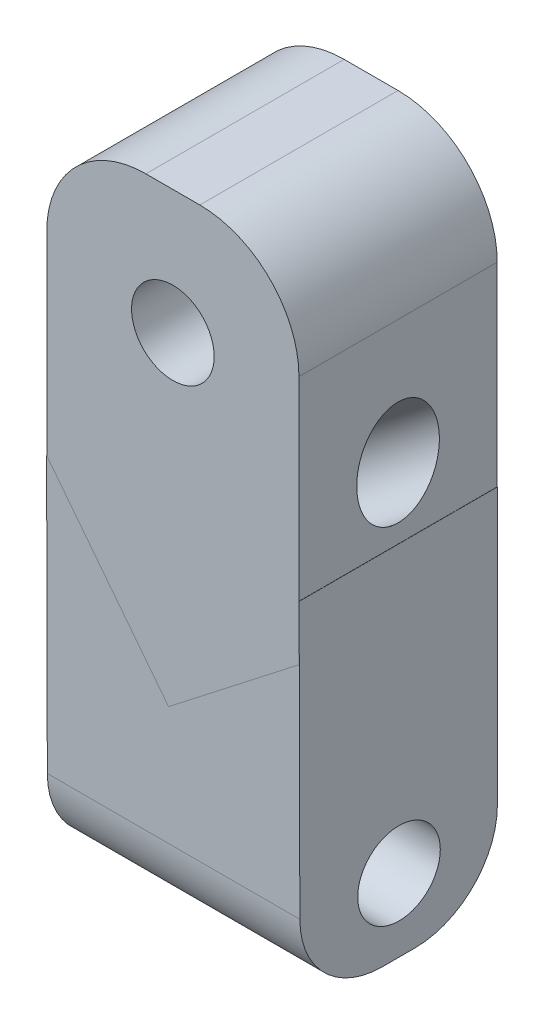
ISO-10303-21;
HEADER;
FILE_DESCRIPTION(('STEP AP214'),'2;1');
FILE_NAME('part.step','',(''),(''),'','','');
FILE_SCHEMA(('AUTOMOTIVE_DESIGN { 1 0 10303 214 1 1 1 1 }'));
ENDSEC;
DATA;
#1=APPLICATION_CONTEXT('core data for automotive mechanical design processes');
#2=APPLICATION_PROTOCOL_DEFINITION('international standard','automotive_design',2000,#1);
#3=PRODUCT_CONTEXT('',#1,'mechanical');
#4=PRODUCT('Part','Part','',(#3));
#5=PRODUCT_RELATED_PRODUCT_CATEGORY('part','',(#4));
#6=PRODUCT_DEFINITION_FORMATION('','',#4);
#7=PRODUCT_DEFINITION_CONTEXT('part definition',#1,'design');
#8=PRODUCT_DEFINITION('design','',#6,#7);
#9=PRODUCT_DEFINITION_SHAPE('','',#8);
#10=(LENGTH_UNIT() NAMED_UNIT(*) SI_UNIT(.MILLI.,.METRE.));
#11=(NAMED_UNIT(*) PLANE_ANGLE_UNIT() SI_UNIT($,.RADIAN.));
#12=(NAMED_UNIT(*) SI_UNIT($,.STERADIAN.) SOLID_ANGLE_UNIT());
#13=UNCERTAINTY_MEASURE_WITH_UNIT(LENGTH_MEASURE(1.E-05),#10,'distance_accuracy_value','');
#14=(GEOMETRIC_REPRESENTATION_CONTEXT(3) GLOBAL_UNCERTAINTY_ASSIGNED_CONTEXT((#13)) GLOBAL_UNIT_ASSIGNED_CONTEXT((#10,
#11,#12)) REPRESENTATION_CONTEXT('',''));
#15=CARTESIAN_POINT('',(0.,0.,0.));
#16=DIRECTION('',(0.,0.,1.));
#17=DIRECTION('',(1.,0.,0.));
#18=AXIS2_PLACEMENT_3D('',#15,#16,#17);
#19=CARTESIAN_POINT('',(38.21,8.31539254256734,30.));
#20=DIRECTION('',(0.,-1.,0.));
#21=DIRECTION('',(0.,0.,-1.));
#22=AXIS2_PLACEMENT_3D('',#19,#20,#21);
#23=PLANE('',#22);
#24=DIRECTION('',(-1.,0.,0.));
#25=VECTOR('',#24,1.);
#26=CARTESIAN_POINT('',(38.21,8.31539254256734,-30.));
#27=LINE('',#26,#25);
#28=CARTESIAN_POINT('',(38.21,8.31539254256734,-30.));
#29=VERTEX_POINT('',#28);
#30=CARTESIAN_POINT('',(38.1556581238355,8.31539254256734,-30.));
#31=VERTEX_POINT('',#30);
#32=EDGE_CURVE('E498',#29,#31,#27,.T.);
#33=ORIENTED_EDGE('',*,*,#32,.T.);
#34=DIRECTION('',(0.,0.,1.));
#35=VECTOR('',#34,1.);
#36=CARTESIAN_POINT('',(38.1556581238355,8.31539254256734,30.));
#37=LINE('',#36,#35);
#38=CARTESIAN_POINT('',(38.1556581238355,8.31539254256734,30.));
#39=VERTEX_POINT('',#38);
#40=EDGE_CURVE('E189',#31,#39,#37,.T.);
#41=ORIENTED_EDGE('',*,*,#40,.T.);
#42=DIRECTION('',(-1.,0.,0.));
#43=VECTOR('',#42,1.);
#44=CARTESIAN_POINT('',(38.21,8.31539254256734,30.));
#45=LINE('',#44,#43);
#46=CARTESIAN_POINT('',(38.21,8.31539254256734,30.));
#47=VERTEX_POINT('',#46);
#48=EDGE_CURVE('E168',#47,#39,#45,.T.);
#49=ORIENTED_EDGE('',*,*,#48,.F.);
#50=DIRECTION('',(0.,0.,1.));
#51=VECTOR('',#50,1.);
#52=CARTESIAN_POINT('',(38.21,8.31539254256734,30.));
#53=LINE('',#52,#51);
#54=EDGE_CURVE('E176',#29,#47,#53,.T.);
#55=ORIENTED_EDGE('',*,*,#54,.F.);
#56=EDGE_LOOP('',(#33,#41,#49,#55));
#57=FACE_BOUND('',#56,.T.);
#58=ADVANCED_FACE('F45',(#57),#23,.F.);
#59=CARTESIAN_POINT('',(-38.1556581238355,8.31539254256734,30.));
#60=VERTEX_POINT('',#59);
#61=CARTESIAN_POINT('',(-38.21,8.31539254256734,30.));
#62=VERTEX_POINT('',#61);
#63=EDGE_CURVE('E74',#60,#62,#45,.T.);
#64=ORIENTED_EDGE('',*,*,#63,.F.);
#65=DIRECTION('',(0.,0.,1.));
#66=VECTOR('',#65,1.);
#67=CARTESIAN_POINT('',(-38.1556581238355,8.31539254256734,30.));
#68=LINE('',#67,#66);
#69=CARTESIAN_POINT('',(-38.1556581238355,8.31539254256734,-30.));
#70=VERTEX_POINT('',#69);
#71=EDGE_CURVE('E254',#70,#60,#68,.T.);
#72=ORIENTED_EDGE('',*,*,#71,.F.);
#73=CARTESIAN_POINT('',(-38.21,8.31539254256734,-30.));
#74=VERTEX_POINT('',#73);
#75=EDGE_CURVE('E480',#70,#74,#27,.T.);
#76=ORIENTED_EDGE('',*,*,#75,.T.);
#77=DIRECTION('',(0.,0.,1.));
#78=VECTOR('',#77,1.);
#79=CARTESIAN_POINT('',(-38.21,8.31539254256734,30.));
#80=LINE('',#79,#78);
#81=EDGE_CURVE('E456',#74,#62,#80,.T.);
#82=ORIENTED_EDGE('',*,*,#81,.T.);
#83=EDGE_LOOP('',(#64,#72,#76,#82));
#84=FACE_BOUND('',#83,.T.);
#85=ADVANCED_FACE('F305',(#84),#23,.F.);
#86=CARTESIAN_POINT('',(38.21,-75.0505472571575,-5.));
#87=DIRECTION('',(-1.,0.,0.));
#88=DIRECTION('',(0.,0.,1.));
#89=AXIS2_PLACEMENT_3D('',#86,#87,#88);
#90=PLANE('',#89);
#91=ORIENTED_EDGE('',*,*,#54,.T.);
#92=DIRECTION('',(0.,-0.999996600917969,-0.00260732669745587));
#93=VECTOR('',#92,1.);
#94=CARTESIAN_POINT('',(38.21,8.31539254256734,30.));
#95=LINE('',#94,#93);
#96=CARTESIAN_POINT('',(38.21,-75.1157304245939,29.7824670662767));
#97=VERTEX_POINT('',#96);
#98=EDGE_CURVE('E164',#47,#97,#95,.T.);
#99=ORIENTED_EDGE('',*,*,#98,.T.);
#100=CARTESIAN_POINT('',(38.21,-75.0505472571575,4.78255204332748));
#101=DIRECTION('',(1.,0.,0.));
#102=DIRECTION('',(0.,0.,-1.));
#103=AXIS2_PLACEMENT_3D('',#100,#101,#102);
#104=CIRCLE('',#103,25.);
#105=CARTESIAN_POINT('',(38.21,-100.050547257158,4.78255204332748));
#106=VERTEX_POINT('',#105);
#107=EDGE_CURVE('E175',#97,#106,#104,.T.);
#108=ORIENTED_EDGE('',*,*,#107,.T.);
#109=DIRECTION('',(0.,0.,-1.));
#110=VECTOR('',#109,1.);
#111=CARTESIAN_POINT('',(38.21,-100.050547257158,4.78255204332748));
#112=LINE('',#111,#110);
#113=CARTESIAN_POINT('',(38.21,-100.050547257158,-5.00000000000001));
#114=VERTEX_POINT('',#113);
#115=EDGE_CURVE('E472',#106,#114,#112,.T.);
#116=ORIENTED_EDGE('',*,*,#115,.T.);
#117=CARTESIAN_POINT('',(38.21,-75.0505472571575,-5.));
#118=DIRECTION('',(1.,0.,0.));
#119=DIRECTION('',(0.,0.,1.));
#120=AXIS2_PLACEMENT_3D('',#117,#118,#119);
#121=CIRCLE('',#120,25.);
#122=CARTESIAN_POINT('',(38.21,-75.0505472571575,-30.));
#123=VERTEX_POINT('',#122);
#124=EDGE_CURVE('E475',#114,#123,#121,.T.);
#125=ORIENTED_EDGE('',*,*,#124,.T.);
#126=DIRECTION('',(0.,1.,0.));
#127=VECTOR('',#126,1.);
#128=CARTESIAN_POINT('',(38.21,8.31539254256734,-30.));
#129=LINE('',#128,#127);
#130=EDGE_CURVE('E182',#123,#29,#129,.T.);
#131=ORIENTED_EDGE('',*,*,#130,.T.);
#132=EDGE_LOOP('',(#91,#99,#108,#116,#125,#131));
#133=FACE_BOUND('',#132,.T.);
#134=CARTESIAN_POINT('',(38.21,-78.0505472571575,-0.22528695882045));
#135=DIRECTION('',(1.,0.,0.));
#136=DIRECTION('',(0.,0.,-1.));
#137=AXIS2_PLACEMENT_3D('',#134,#135,#136);
#138=CIRCLE('',#137,12.5);
#139=CARTESIAN_POINT('',(38.21,-78.0505472571575,-12.7252869588204));
#140=VERTEX_POINT('',#139);
#141=EDGE_CURVE('E462',#140,#140,#138,.T.);
#142=ORIENTED_EDGE('',*,*,#141,.F.);
#143=EDGE_LOOP('',(#142));
#144=FACE_BOUND('',#143,.T.);
#145=ADVANCED_FACE('F179',(#133,#144),#90,.F.);
#146=CARTESIAN_POINT('',(-38.21,-75.0505472571575,-5.));
#147=DIRECTION('',(-1.,0.,0.));
#148=DIRECTION('',(0.,0.,1.));
#149=AXIS2_PLACEMENT_3D('',#146,#147,#148);
#150=PLANE('',#149);
#151=CARTESIAN_POINT('',(-38.21,-29.7456734293375,0.));
#152=DIRECTION('',(-1.,0.,0.));
#153=DIRECTION('',(0.,1.,0.));
#154=AXIS2_PLACEMENT_3D('',#151,#152,#153);
#155=ELLIPSE('',#154,15.8411508231327,12.5);
#156=CARTESIAN_POINT('',(-38.21,-13.9045226062049,0.));
#157=VERTEX_POINT('',#156);
#158=EDGE_CURVE('E452',#157,#157,#155,.T.);
#159=ORIENTED_EDGE('',*,*,#158,.F.);
#160=EDGE_LOOP('',(#159));
#161=FACE_BOUND('',#160,.T.);
#162=ORIENTED_EDGE('',*,*,#81,.F.);
#163=DIRECTION('',(0.,1.,0.));
#164=VECTOR('',#163,1.);
#165=CARTESIAN_POINT('',(-38.21,8.31539254256734,-30.));
#166=LINE('',#165,#164);
#167=CARTESIAN_POINT('',(-38.21,-75.0505472571575,-30.));
#168=VERTEX_POINT('',#167);
#169=EDGE_CURVE('E186',#168,#74,#166,.T.);
#170=ORIENTED_EDGE('',*,*,#169,.F.);
#171=CARTESIAN_POINT('',(-38.21,-75.0505472571575,-5.));
#172=DIRECTION('',(1.,0.,0.));
#173=DIRECTION('',(0.,0.,1.));
#174=AXIS2_PLACEMENT_3D('',#171,#172,#173);
#175=CIRCLE('',#174,25.);
#176=CARTESIAN_POINT('',(-38.21,-100.050547257158,-5.00000000000001));
#177=VERTEX_POINT('',#176);
#178=EDGE_CURVE('E492',#177,#168,#175,.T.);
#179=ORIENTED_EDGE('',*,*,#178,.F.);
#180=DIRECTION('',(0.,0.,-1.));
#181=VECTOR('',#180,1.);
#182=CARTESIAN_POINT('',(-38.21,-100.050547257158,4.78255204332748));
#183=LINE('',#182,#181);
#184=CARTESIAN_POINT('',(-38.21,-100.050547257158,4.78255204332748));
#185=VERTEX_POINT('',#184);
#186=EDGE_CURVE('E489',#185,#177,#183,.T.);
#187=ORIENTED_EDGE('',*,*,#186,.F.);
#188=CARTESIAN_POINT('',(-38.21,-75.0505472571575,4.78255204332748));
#189=DIRECTION('',(1.,0.,0.));
#190=DIRECTION('',(0.,0.,-1.));
#191=AXIS2_PLACEMENT_3D('',#188,#189,#190);
#192=CIRCLE('',#191,25.);
#193=CARTESIAN_POINT('',(-38.21,-75.1157304245939,29.7824670662767));
#194=VERTEX_POINT('',#193);
#195=EDGE_CURVE('E486',#194,#185,#192,.T.);
#196=ORIENTED_EDGE('',*,*,#195,.F.);
#197=DIRECTION('',(0.,-0.999996600917969,-0.00260732669745587));
#198=VECTOR('',#197,1.);
#199=CARTESIAN_POINT('',(-38.21,8.31539254256734,30.));
#200=LINE('',#199,#198);
#201=EDGE_CURVE('E483',#62,#194,#200,.T.);
#202=ORIENTED_EDGE('',*,*,#201,.F.);
#203=EDGE_LOOP('',(#162,#170,#179,#187,#196,#202));
#204=FACE_BOUND('',#203,.T.);
#205=CARTESIAN_POINT('',(-38.21,-78.0505472571575,-0.22528695882045));
#206=DIRECTION('',(1.,0.,0.));
#207=DIRECTION('',(0.,0.,-1.));
#208=AXIS2_PLACEMENT_3D('',#205,#206,#207);
#209=CIRCLE('',#208,12.5);
#210=CARTESIAN_POINT('',(-38.21,-78.0505472571575,-12.7252869588204));
#211=VERTEX_POINT('',#210);
#212=EDGE_CURVE('E459',#211,#211,#209,.T.);
#213=ORIENTED_EDGE('',*,*,#212,.T.);
#214=EDGE_LOOP('',(#213));
#215=FACE_BOUND('',#214,.T.);
#216=ADVANCED_FACE('F356',(#161,#204,#215),#150,.T.);
#217=CARTESIAN_POINT('',(38.21,8.31539254256734,30.));
#218=DIRECTION('',(0.,0.00260732669745587,-0.999996600917969));
#219=DIRECTION('',(0.,0.999996600917969,0.00260732669745587));
#220=AXIS2_PLACEMENT_3D('',#217,#218,#219);
#221=PLANE('',#220);
#222=DIRECTION('',(0.614283899991924,-0.789082414773697,-0.00205740263981275));
#223=VECTOR('',#222,1.);
#224=CARTESIAN_POINT('',(-19.6892652476825,-15.4057336062153,29.938151064269));
#225=LINE('',#224,#223);
#226=CARTESIAN_POINT('',(-1.29854611789917,-39.0296525475143,29.8765555803467));
#227=VERTEX_POINT('',#226);
#228=EDGE_CURVE('E201',#60,#227,#225,.T.);
#229=ORIENTED_EDGE('',*,*,#228,.F.);
#230=ORIENTED_EDGE('',*,*,#63,.T.);
#231=ORIENTED_EDGE('',*,*,#201,.T.);
#232=DIRECTION('',(-1.,0.,0.));
#233=VECTOR('',#232,1.);
#234=CARTESIAN_POINT('',(38.21,-75.1157304245939,29.7824670662767));
#235=LINE('',#234,#233);
#236=EDGE_CURVE('E171',#97,#194,#235,.T.);
#237=ORIENTED_EDGE('',*,*,#236,.F.);
#238=ORIENTED_EDGE('',*,*,#98,.F.);
#239=ORIENTED_EDGE('',*,*,#48,.T.);
#240=DIRECTION('',(0.,-0.999996600917969,-0.00260732669745587));
#241=VECTOR('',#240,1.);
#242=CARTESIAN_POINT('',(38.1556581238355,-8.31527948395404,29.9566382574385));
#243=LINE('',#242,#241);
#244=CARTESIAN_POINT('',(38.1556581238355,-8.31539254256736,29.9566379626568));
#245=VERTEX_POINT('',#244);
#246=EDGE_CURVE('E11',#39,#245,#243,.T.);
#247=ORIENTED_EDGE('',*,*,#246,.T.);
#248=DIRECTION('',(-0.789083072727731,-0.614284412195165,-0.00160164559187219));
#249=VECTOR('',#248,1.);
#250=CARTESIAN_POINT('',(38.155712926141,-8.31534988013656,29.956638073892));
#251=LINE('',#250,#249);
#252=EDGE_CURVE('E194',#245,#227,#251,.T.);
#253=ORIENTED_EDGE('',*,*,#252,.T.);
#254=EDGE_LOOP('',(#229,#230,#231,#237,#238,#239,#247,#253));
#255=FACE_BOUND('',#254,.T.);
#256=ADVANCED_FACE('F166',(#255),#221,.F.);
#257=CARTESIAN_POINT('',(38.21,-75.0505472571575,4.78255204332748));
#258=DIRECTION('',(-1.,0.,0.));
#259=DIRECTION('',(0.,0.,1.));
#260=AXIS2_PLACEMENT_3D('',#257,#258,#259);
#261=CYLINDRICAL_SURFACE('',#260,25.);
#262=ORIENTED_EDGE('',*,*,#195,.T.);
#263=DIRECTION('',(-1.,0.,0.));
#264=VECTOR('',#263,1.);
#265=CARTESIAN_POINT('',(38.21,-100.050547257158,4.78255204332748));
#266=LINE('',#265,#264);
#267=EDGE_CURVE('E508',#106,#185,#266,.T.);
#268=ORIENTED_EDGE('',*,*,#267,.F.);
#269=ORIENTED_EDGE('',*,*,#107,.F.);
#270=ORIENTED_EDGE('',*,*,#236,.T.);
#271=EDGE_LOOP('',(#262,#268,#269,#270));
#272=FACE_BOUND('',#271,.T.);
#273=ADVANCED_FACE('F400',(#272),#261,.T.);
#274=CARTESIAN_POINT('',(38.21,-100.050547257158,4.78255204332748));
#275=DIRECTION('',(0.,1.,0.));
#276=DIRECTION('',(0.,0.,1.));
#277=AXIS2_PLACEMENT_3D('',#274,#275,#276);
#278=PLANE('',#277);
#279=ORIENTED_EDGE('',*,*,#186,.T.);
#280=DIRECTION('',(-1.,0.,0.));
#281=VECTOR('',#280,1.);
#282=CARTESIAN_POINT('',(38.21,-100.050547257158,-5.00000000000001));
#283=LINE('',#282,#281);
#284=EDGE_CURVE('E505',#114,#177,#283,.T.);
#285=ORIENTED_EDGE('',*,*,#284,.F.);
#286=ORIENTED_EDGE('',*,*,#115,.F.);
#287=ORIENTED_EDGE('',*,*,#267,.T.);
#288=EDGE_LOOP('',(#279,#285,#286,#287));
#289=FACE_BOUND('',#288,.T.);
#290=ADVANCED_FACE('F390',(#289),#278,.F.);
#291=CARTESIAN_POINT('',(38.21,-75.0505472571575,-5.));
#292=DIRECTION('',(-1.,0.,0.));
#293=DIRECTION('',(0.,0.,1.));
#294=AXIS2_PLACEMENT_3D('',#291,#292,#293);
#295=CYLINDRICAL_SURFACE('',#294,25.);
#296=ORIENTED_EDGE('',*,*,#178,.T.);
#297=DIRECTION('',(-1.,0.,0.));
#298=VECTOR('',#297,1.);
#299=CARTESIAN_POINT('',(38.21,-75.0505472571575,-30.));
#300=LINE('',#299,#298);
#301=EDGE_CURVE('E501',#123,#168,#300,.T.);
#302=ORIENTED_EDGE('',*,*,#301,.F.);
#303=ORIENTED_EDGE('',*,*,#124,.F.);
#304=ORIENTED_EDGE('',*,*,#284,.T.);
#305=EDGE_LOOP('',(#296,#302,#303,#304));
#306=FACE_BOUND('',#305,.T.);
#307=ADVANCED_FACE('F380',(#306),#295,.T.);
#308=CARTESIAN_POINT('',(38.21,-78.0505472571575,-0.22528695882045));
#309=DIRECTION('',(-1.,0.,0.));
#310=DIRECTION('',(0.,0.,1.));
#311=AXIS2_PLACEMENT_3D('',#308,#309,#310);
#312=CYLINDRICAL_SURFACE('',#311,12.5);
#313=ORIENTED_EDGE('',*,*,#141,.T.);
#314=EDGE_LOOP('',(#313));
#315=FACE_BOUND('',#314,.T.);
#316=ORIENTED_EDGE('',*,*,#212,.F.);
#317=EDGE_LOOP('',(#316));
#318=FACE_BOUND('',#317,.T.);
#319=ADVANCED_FACE('F329',(#315,#318),#312,.F.);
#320=CARTESIAN_POINT('',(-19.7271021208674,-15.3571300024735,0.));
#321=DIRECTION('',(-0.789084084834694,-0.614285200098939,0.));
#322=DIRECTION('',(0.614285200098939,-0.789084084834694,0.));
#323=AXIS2_PLACEMENT_3D('',#320,#321,#322);
#324=PLANE('',#323);
#325=DIRECTION('',(0.614285200098939,-0.789084084834694,0.));
#326=VECTOR('',#325,1.);
#327=CARTESIAN_POINT('',(-1.29854611789917,-39.0296525475143,30.));
#328=LINE('',#327,#326);
#329=CARTESIAN_POINT('',(-1.29854611789917,-39.0296525475143,30.));
#330=VERTEX_POINT('',#329);
#331=EDGE_CURVE('E263',#60,#330,#328,.T.);
#332=ORIENTED_EDGE('',*,*,#331,.F.);
#333=ORIENTED_EDGE('',*,*,#228,.T.);
#334=DIRECTION('',(0.,0.,-1.));
#335=VECTOR('',#334,1.);
#336=CARTESIAN_POINT('',(-1.29854611789917,-39.0296525475143,30.));
#337=LINE('',#336,#335);
#338=EDGE_CURVE('E259',#330,#227,#337,.T.);
#339=ORIENTED_EDGE('',*,*,#338,.F.);
#340=EDGE_LOOP('',(#332,#333,#339));
#341=FACE_BOUND('',#340,.T.);
#342=ADVANCED_FACE('F277',(#341),#324,.T.);
#343=CARTESIAN_POINT('',(38.1556581238355,-8.31539254256736,30.));
#344=DIRECTION('',(-0.614285200098939,0.789084084834694,0.));
#345=DIRECTION('',(-0.789084084834694,-0.614285200098939,0.));
#346=AXIS2_PLACEMENT_3D('',#343,#344,#345);
#347=PLANE('',#346);
#348=ORIENTED_EDGE('',*,*,#252,.F.);
#349=DIRECTION('',(0.,0.,-1.));
#350=VECTOR('',#349,1.);
#351=CARTESIAN_POINT('',(38.1556581238355,-8.31539254256736,30.));
#352=LINE('',#351,#350);
#353=CARTESIAN_POINT('',(38.1556581238355,-8.31539254256736,30.));
#354=VERTEX_POINT('',#353);
#355=EDGE_CURVE('E255',#354,#245,#352,.T.);
#356=ORIENTED_EDGE('',*,*,#355,.F.);
#357=DIRECTION('',(-0.789084084834694,-0.614285200098939,0.));
#358=VECTOR('',#357,1.);
#359=CARTESIAN_POINT('',(38.1556581238355,-8.31539254256736,30.));
#360=LINE('',#359,#358);
#361=EDGE_CURVE('E56',#354,#330,#360,.T.);
#362=ORIENTED_EDGE('',*,*,#361,.T.);
#363=ORIENTED_EDGE('',*,*,#338,.T.);
#364=EDGE_LOOP('',(#348,#356,#362,#363));
#365=FACE_BOUND('',#364,.T.);
#366=ADVANCED_FACE('F273',(#365),#347,.F.);
#367=CARTESIAN_POINT('',(38.1556581238355,-8.31539254256736,30.));
#368=DIRECTION('',(-1.,0.,0.));
#369=DIRECTION('',(0.,0.,1.));
#370=AXIS2_PLACEMENT_3D('',#367,#368,#369);
#371=PLANE('',#370);
#372=CARTESIAN_POINT('',(38.1556581238355,29.703369432951,0.));
#373=DIRECTION('',(-1.,0.,0.));
#374=DIRECTION('',(0.,1.,0.));
#375=AXIS2_PLACEMENT_3D('',#372,#373,#374);
#376=ELLIPSE('',#375,15.8411508231327,12.5);
#377=CARTESIAN_POINT('',(38.1556581238355,45.5445202560837,0.));
#378=VERTEX_POINT('',#377);
#379=EDGE_CURVE('E49',#378,#378,#376,.T.);
#380=ORIENTED_EDGE('',*,*,#379,.T.);
#381=EDGE_LOOP('',(#380));
#382=FACE_BOUND('',#381,.T.);
#383=ORIENTED_EDGE('',*,*,#40,.F.);
#384=DIRECTION('',(0.,1.,0.));
#385=VECTOR('',#384,1.);
#386=CARTESIAN_POINT('',(38.1556581238355,-8.31539254256736,-30.));
#387=LINE('',#386,#385);
#388=CARTESIAN_POINT('',(38.1556581238355,67.179146139051,-30.));
#389=VERTEX_POINT('',#388);
#390=EDGE_CURVE('E210',#31,#389,#387,.T.);
#391=ORIENTED_EDGE('',*,*,#390,.T.);
#392=DIRECTION('',(0.,0.,-1.));
#393=VECTOR('',#392,1.);
#394=CARTESIAN_POINT('',(38.1556581238355,67.179146139051,30.));
#395=LINE('',#394,#393);
#396=CARTESIAN_POINT('',(38.1556581238355,67.179146139051,30.));
#397=VERTEX_POINT('',#396);
#398=EDGE_CURVE('E250',#397,#389,#395,.T.);
#399=ORIENTED_EDGE('',*,*,#398,.F.);
#400=DIRECTION('',(0.,1.,0.));
#401=VECTOR('',#400,1.);
#402=CARTESIAN_POINT('',(38.1556581238355,-8.31539254256736,30.));
#403=LINE('',#402,#401);
#404=EDGE_CURVE('E112',#39,#397,#403,.T.);
#405=ORIENTED_EDGE('',*,*,#404,.F.);
#406=EDGE_LOOP('',(#383,#391,#399,#405));
#407=FACE_BOUND('',#406,.T.);
#408=ADVANCED_FACE('F301',(#382,#407),#371,.F.);
#409=ORIENTED_EDGE('',*,*,#246,.F.);
#410=EDGE_CURVE('E214',#354,#39,#403,.T.);
#411=ORIENTED_EDGE('',*,*,#410,.F.);
#412=ORIENTED_EDGE('',*,*,#355,.T.);
#413=EDGE_LOOP('',(#409,#411,#412));
#414=FACE_BOUND('',#413,.T.);
#415=ADVANCED_FACE('F280',(#414),#371,.F.);
#416=CARTESIAN_POINT('',(38.1556581238355,-8.31539254256736,-30.));
#417=DIRECTION('',(0.,0.,1.));
#418=DIRECTION('',(1.,0.,0.));
#419=AXIS2_PLACEMENT_3D('',#416,#417,#418);
#420=PLANE('',#419);
#421=ORIENTED_EDGE('',*,*,#75,.F.);
#422=DIRECTION('',(0.,-1.,0.));
#423=VECTOR('',#422,1.);
#424=CARTESIAN_POINT('',(-38.1556581238355,67.179146139051,-30.));
#425=LINE('',#424,#423);
#426=CARTESIAN_POINT('',(-38.1556581238355,67.179146139051,-30.));
#427=VERTEX_POINT('',#426);
#428=EDGE_CURVE('E238',#427,#70,#425,.T.);
#429=ORIENTED_EDGE('',*,*,#428,.F.);
#430=CARTESIAN_POINT('',(-8.15565812383553,67.179146139051,-30.));
#431=DIRECTION('',(0.,0.,1.));
#432=DIRECTION('',(1.,0.,0.));
#433=AXIS2_PLACEMENT_3D('',#430,#431,#432);
#434=CIRCLE('',#433,30.);
#435=CARTESIAN_POINT('',(-8.15565812383553,97.179146139051,-30.));
#436=VERTEX_POINT('',#435);
#437=EDGE_CURVE('E106',#436,#427,#434,.T.);
#438=ORIENTED_EDGE('',*,*,#437,.F.);
#439=DIRECTION('',(-1.,0.,0.));
#440=VECTOR('',#439,1.);
#441=CARTESIAN_POINT('',(8.15565812383553,97.179146139051,-30.));
#442=LINE('',#441,#440);
#443=CARTESIAN_POINT('',(8.15565812383553,97.179146139051,-30.));
#444=VERTEX_POINT('',#443);
#445=EDGE_CURVE('E100',#444,#436,#442,.T.);
#446=ORIENTED_EDGE('',*,*,#445,.F.);
#447=CARTESIAN_POINT('',(8.15565812383553,67.179146139051,-30.));
#448=DIRECTION('',(0.,0.,1.));
#449=DIRECTION('',(-1.,0.,0.));
#450=AXIS2_PLACEMENT_3D('',#447,#448,#449);
#451=CIRCLE('',#450,30.);
#452=EDGE_CURVE('E231',#389,#444,#451,.T.);
#453=ORIENTED_EDGE('',*,*,#452,.F.);
#454=ORIENTED_EDGE('',*,*,#390,.F.);
#455=ORIENTED_EDGE('',*,*,#32,.F.);
#456=ORIENTED_EDGE('',*,*,#130,.F.);
#457=ORIENTED_EDGE('',*,*,#301,.T.);
#458=ORIENTED_EDGE('',*,*,#169,.T.);
#459=EDGE_LOOP('',(#421,#429,#438,#446,#453,#454,#455,#456,#457,#458));
#460=FACE_BOUND('',#459,.T.);
#461=CARTESIAN_POINT('',(0.,59.5972752616831,-30.));
#462=DIRECTION('',(0.,0.,1.));
#463=DIRECTION('',(1.,0.,0.));
#464=AXIS2_PLACEMENT_3D('',#461,#462,#463);
#465=CIRCLE('',#464,12.5);
#466=CARTESIAN_POINT('',(12.5,59.5972752616831,-30.));
#467=VERTEX_POINT('',#466);
#468=EDGE_CURVE('E205',#467,#467,#465,.T.);
#469=ORIENTED_EDGE('',*,*,#468,.T.);
#470=EDGE_LOOP('',(#469));
#471=FACE_BOUND('',#470,.T.);
#472=ADVANCED_FACE('F47',(#460,#471),#420,.F.);
#473=CARTESIAN_POINT('',(38.1556581238355,-8.31539254256736,30.));
#474=DIRECTION('',(0.,0.,-1.));
#475=DIRECTION('',(-1.,0.,0.));
#476=AXIS2_PLACEMENT_3D('',#473,#474,#475);
#477=PLANE('',#476);
#478=DIRECTION('',(0.,-1.,0.));
#479=VECTOR('',#478,1.);
#480=CARTESIAN_POINT('',(-38.1556581238355,67.179146139051,30.));
#481=LINE('',#480,#479);
#482=CARTESIAN_POINT('',(-38.1556581238355,67.179146139051,30.));
#483=VERTEX_POINT('',#482);
#484=EDGE_CURVE('E225',#483,#60,#481,.T.);
#485=ORIENTED_EDGE('',*,*,#484,.T.);
#486=ORIENTED_EDGE('',*,*,#331,.T.);
#487=ORIENTED_EDGE('',*,*,#361,.F.);
#488=ORIENTED_EDGE('',*,*,#410,.T.);
#489=ORIENTED_EDGE('',*,*,#404,.T.);
#490=CARTESIAN_POINT('',(8.15565812383553,67.179146139051,30.));
#491=DIRECTION('',(0.,0.,1.));
#492=DIRECTION('',(-1.,0.,0.));
#493=AXIS2_PLACEMENT_3D('',#490,#491,#492);
#494=CIRCLE('',#493,30.);
#495=CARTESIAN_POINT('',(8.15565812383553,97.179146139051,30.));
#496=VERTEX_POINT('',#495);
#497=EDGE_CURVE('E217',#397,#496,#494,.T.);
#498=ORIENTED_EDGE('',*,*,#497,.T.);
#499=DIRECTION('',(-1.,0.,0.));
#500=VECTOR('',#499,1.);
#501=CARTESIAN_POINT('',(8.15565812383553,97.179146139051,30.));
#502=LINE('',#501,#500);
#503=CARTESIAN_POINT('',(-8.15565812383553,97.179146139051,30.));
#504=VERTEX_POINT('',#503);
#505=EDGE_CURVE('E220',#496,#504,#502,.T.);
#506=ORIENTED_EDGE('',*,*,#505,.T.);
#507=CARTESIAN_POINT('',(-8.15565812383553,67.179146139051,30.));
#508=DIRECTION('',(0.,0.,1.));
#509=DIRECTION('',(1.,0.,0.));
#510=AXIS2_PLACEMENT_3D('',#507,#508,#509);
#511=CIRCLE('',#510,30.);
#512=EDGE_CURVE('E82',#504,#483,#511,.T.);
#513=ORIENTED_EDGE('',*,*,#512,.T.);
#514=EDGE_LOOP('',(#485,#486,#487,#488,#489,#498,#506,#513));
#515=FACE_BOUND('',#514,.T.);
#516=CARTESIAN_POINT('',(0.,59.5972752616831,30.));
#517=DIRECTION('',(0.,0.,1.));
#518=DIRECTION('',(1.,0.,0.));
#519=AXIS2_PLACEMENT_3D('',#516,#517,#518);
#520=CIRCLE('',#519,12.5);
#521=CARTESIAN_POINT('',(12.5,59.5972752616831,30.));
#522=VERTEX_POINT('',#521);
#523=EDGE_CURVE('E206',#522,#522,#520,.T.);
#524=ORIENTED_EDGE('',*,*,#523,.F.);
#525=EDGE_LOOP('',(#524));
#526=FACE_BOUND('',#525,.T.);
#527=ADVANCED_FACE('F281',(#515,#526),#477,.F.);
#528=CARTESIAN_POINT('',(8.15565812383553,67.179146139051,30.));
#529=DIRECTION('',(0.,0.,-1.));
#530=DIRECTION('',(-1.,0.,0.));
#531=AXIS2_PLACEMENT_3D('',#528,#529,#530);
#532=CYLINDRICAL_SURFACE('',#531,30.);
#533=ORIENTED_EDGE('',*,*,#452,.T.);
#534=DIRECTION('',(0.,0.,-1.));
#535=VECTOR('',#534,1.);
#536=CARTESIAN_POINT('',(8.15565812383553,97.179146139051,30.));
#537=LINE('',#536,#535);
#538=EDGE_CURVE('E247',#496,#444,#537,.T.);
#539=ORIENTED_EDGE('',*,*,#538,.F.);
#540=ORIENTED_EDGE('',*,*,#497,.F.);
#541=ORIENTED_EDGE('',*,*,#398,.T.);
#542=EDGE_LOOP('',(#533,#539,#540,#541));
#543=FACE_BOUND('',#542,.T.);
#544=ADVANCED_FACE('F285',(#543),#532,.T.);
#545=CARTESIAN_POINT('',(8.15565812383553,97.179146139051,30.));
#546=DIRECTION('',(0.,-1.,0.));
#547=DIRECTION('',(1.,0.,0.));
#548=AXIS2_PLACEMENT_3D('',#545,#546,#547);
#549=PLANE('',#548);
#550=ORIENTED_EDGE('',*,*,#445,.T.);
#551=DIRECTION('',(0.,0.,-1.));
#552=VECTOR('',#551,1.);
#553=CARTESIAN_POINT('',(-8.15565812383553,97.179146139051,30.));
#554=LINE('',#553,#552);
#555=EDGE_CURVE('E244',#504,#436,#554,.T.);
#556=ORIENTED_EDGE('',*,*,#555,.F.);
#557=ORIENTED_EDGE('',*,*,#505,.F.);
#558=ORIENTED_EDGE('',*,*,#538,.T.);
#559=EDGE_LOOP('',(#550,#556,#557,#558));
#560=FACE_BOUND('',#559,.T.);
#561=ADVANCED_FACE('F319',(#560),#549,.F.);
#562=CARTESIAN_POINT('',(-8.15565812383553,67.179146139051,30.));
#563=DIRECTION('',(0.,0.,-1.));
#564=DIRECTION('',(-1.,0.,0.));
#565=AXIS2_PLACEMENT_3D('',#562,#563,#564);
#566=CYLINDRICAL_SURFACE('',#565,30.);
#567=ORIENTED_EDGE('',*,*,#437,.T.);
#568=DIRECTION('',(0.,0.,-1.));
#569=VECTOR('',#568,1.);
#570=CARTESIAN_POINT('',(-38.1556581238355,67.179146139051,30.));
#571=LINE('',#570,#569);
#572=EDGE_CURVE('E228',#483,#427,#571,.T.);
#573=ORIENTED_EDGE('',*,*,#572,.F.);
#574=ORIENTED_EDGE('',*,*,#512,.F.);
#575=ORIENTED_EDGE('',*,*,#555,.T.);
#576=EDGE_LOOP('',(#567,#573,#574,#575));
#577=FACE_BOUND('',#576,.T.);
#578=ADVANCED_FACE('F315',(#577),#566,.T.);
#579=CARTESIAN_POINT('',(-38.1556581238355,67.179146139051,30.));
#580=DIRECTION('',(1.,0.,0.));
#581=DIRECTION('',(0.,0.,-1.));
#582=AXIS2_PLACEMENT_3D('',#579,#580,#581);
#583=PLANE('',#582);
#584=ORIENTED_EDGE('',*,*,#428,.T.);
#585=ORIENTED_EDGE('',*,*,#71,.T.);
#586=ORIENTED_EDGE('',*,*,#484,.F.);
#587=ORIENTED_EDGE('',*,*,#572,.T.);
#588=EDGE_LOOP('',(#584,#585,#586,#587));
#589=FACE_BOUND('',#588,.T.);
#590=ADVANCED_FACE('F292',(#589),#583,.F.);
#591=CARTESIAN_POINT('',(0.,59.5972752616831,30.));
#592=DIRECTION('',(0.,0.,-1.));
#593=DIRECTION('',(-1.,0.,0.));
#594=AXIS2_PLACEMENT_3D('',#591,#592,#593);
#595=CYLINDRICAL_SURFACE('',#594,12.5);
#596=ORIENTED_EDGE('',*,*,#523,.T.);
#597=EDGE_LOOP('',(#596));
#598=FACE_BOUND('',#597,.T.);
#599=ORIENTED_EDGE('',*,*,#468,.F.);
#600=EDGE_LOOP('',(#599));
#601=FACE_BOUND('',#600,.T.);
#602=ADVANCED_FACE('F288',(#598,#601),#595,.F.);
#603=CARTESIAN_POINT('',(-90.7446697559898,-70.642798011378,0.));
#604=DIRECTION('',(0.789084084834694,0.614285200098939,0.));
#605=DIRECTION('',(-0.614285200098939,0.789084084834694,0.));
#606=AXIS2_PLACEMENT_3D('',#603,#604,#605);
#607=CYLINDRICAL_SURFACE('',#606,12.5);
#608=ORIENTED_EDGE('',*,*,#158,.T.);
#609=EDGE_LOOP('',(#608));
#610=FACE_BOUND('',#609,.T.);
#611=ORIENTED_EDGE('',*,*,#379,.F.);
#612=EDGE_LOOP('',(#611));
#613=FACE_BOUND('',#612,.T.);
#614=ADVANCED_FACE('F291',(#610,#613),#607,.F.);
#615=CLOSED_SHELL('',(#58,#85,#145,#216,#256,#273,#290,#307,#319,#342,#366,#408,#415,#472,#527,
#544,#561,#578,#590,#602,#614));
#616=MANIFOLD_SOLID_BREP('B2',#615);
#617=ADVANCED_BREP_SHAPE_REPRESENTATION('',(#18,#616),#14);
#618=SHAPE_DEFINITION_REPRESENTATION(#9,#617);
ENDSEC;
END-ISO-10303-21;
